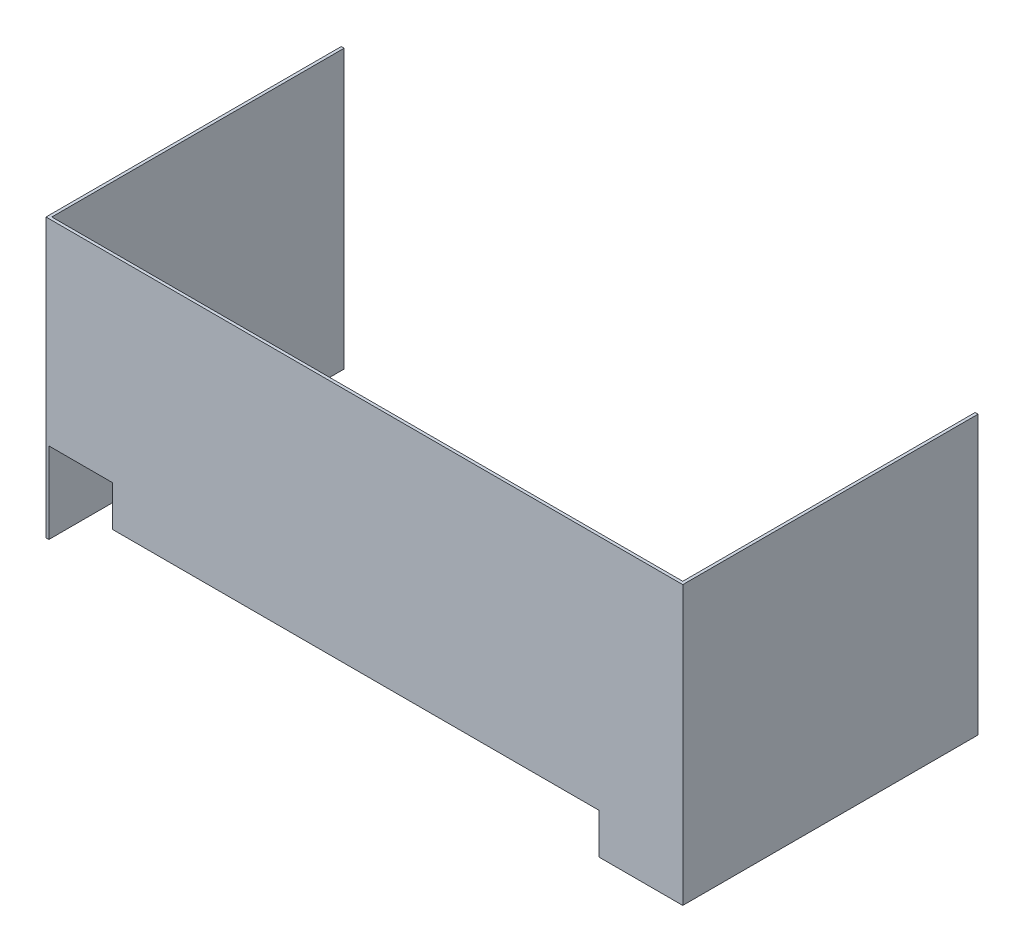
ISO-10303-21;
HEADER;
FILE_DESCRIPTION(('STEP AP214'),'2;1');
FILE_NAME('part.step','',(''),(''),'','','');
FILE_SCHEMA(('AUTOMOTIVE_DESIGN { 1 0 10303 214 1 1 1 1 }'));
ENDSEC;
DATA;
#1=APPLICATION_CONTEXT('core data for automotive mechanical design processes');
#2=APPLICATION_PROTOCOL_DEFINITION('international standard','automotive_design',2000,#1);
#3=PRODUCT_CONTEXT('',#1,'mechanical');
#4=PRODUCT('Part','Part','',(#3));
#5=PRODUCT_RELATED_PRODUCT_CATEGORY('part','',(#4));
#6=PRODUCT_DEFINITION_FORMATION('','',#4);
#7=PRODUCT_DEFINITION_CONTEXT('part definition',#1,'design');
#8=PRODUCT_DEFINITION('design','',#6,#7);
#9=PRODUCT_DEFINITION_SHAPE('','',#8);
#10=(LENGTH_UNIT() NAMED_UNIT(*) SI_UNIT(.MILLI.,.METRE.));
#11=(NAMED_UNIT(*) PLANE_ANGLE_UNIT() SI_UNIT($,.RADIAN.));
#12=(NAMED_UNIT(*) SI_UNIT($,.STERADIAN.) SOLID_ANGLE_UNIT());
#13=UNCERTAINTY_MEASURE_WITH_UNIT(LENGTH_MEASURE(1.E-05),#10,'distance_accuracy_value','');
#14=(GEOMETRIC_REPRESENTATION_CONTEXT(3) GLOBAL_UNCERTAINTY_ASSIGNED_CONTEXT((#13)) GLOBAL_UNIT_ASSIGNED_CONTEXT((#10,
#11,#12)) REPRESENTATION_CONTEXT('',''));
#15=CARTESIAN_POINT('',(0.,0.,0.));
#16=DIRECTION('',(0.,0.,1.));
#17=DIRECTION('',(1.,0.,0.));
#18=AXIS2_PLACEMENT_3D('',#15,#16,#17);
#19=CARTESIAN_POINT('',(292.1,304.8,127.));
#20=DIRECTION('',(0.,0.,1.));
#21=DIRECTION('',(1.,0.,0.));
#22=AXIS2_PLACEMENT_3D('',#19,#20,#21);
#23=PLANE('',#22);
#24=DIRECTION('',(-1.,0.,0.));
#25=VECTOR('',#24,1.);
#26=CARTESIAN_POINT('',(257.175,44.45,127.));
#27=LINE('',#26,#25);
#28=CARTESIAN_POINT('',(257.175,44.45,127.));
#29=VERTEX_POINT('',#28);
#30=CARTESIAN_POINT('',(-276.225,44.45,127.));
#31=VERTEX_POINT('',#30);
#32=EDGE_CURVE('E58',#29,#31,#27,.T.);
#33=ORIENTED_EDGE('',*,*,#32,.F.);
#34=DIRECTION('',(0.,1.,0.));
#35=VECTOR('',#34,1.);
#36=CARTESIAN_POINT('',(257.175,0.,127.));
#37=LINE('',#36,#35);
#38=CARTESIAN_POINT('',(257.175,0.,127.));
#39=VERTEX_POINT('',#38);
#40=EDGE_CURVE('E249',#39,#29,#37,.T.);
#41=ORIENTED_EDGE('',*,*,#40,.F.);
#42=DIRECTION('',(-1.,0.,0.));
#43=VECTOR('',#42,1.);
#44=CARTESIAN_POINT('',(292.1,0.,127.));
#45=LINE('',#44,#43);
#46=CARTESIAN_POINT('',(349.25,0.,127.));
#47=VERTEX_POINT('',#46);
#48=EDGE_CURVE('E161',#47,#39,#45,.T.);
#49=ORIENTED_EDGE('',*,*,#48,.F.);
#50=DIRECTION('',(0.,-1.,0.));
#51=VECTOR('',#50,1.);
#52=CARTESIAN_POINT('',(349.25,304.8,127.));
#53=LINE('',#52,#51);
#54=CARTESIAN_POINT('',(349.25,304.8,127.));
#55=VERTEX_POINT('',#54);
#56=EDGE_CURVE('E175',#55,#47,#53,.T.);
#57=ORIENTED_EDGE('',*,*,#56,.F.);
#58=DIRECTION('',(-1.,0.,0.));
#59=VECTOR('',#58,1.);
#60=CARTESIAN_POINT('',(-349.25,304.8,127.));
#61=LINE('',#60,#59);
#62=CARTESIAN_POINT('',(-349.25,304.8,127.));
#63=VERTEX_POINT('',#62);
#64=EDGE_CURVE('E144',#55,#63,#61,.T.);
#65=ORIENTED_EDGE('',*,*,#64,.T.);
#66=DIRECTION('',(0.,-1.,0.));
#67=VECTOR('',#66,1.);
#68=CARTESIAN_POINT('',(-349.25,304.8,127.));
#69=LINE('',#68,#67);
#70=CARTESIAN_POINT('',(-349.25,0.,127.));
#71=VERTEX_POINT('',#70);
#72=EDGE_CURVE('E177',#63,#71,#69,.T.);
#73=ORIENTED_EDGE('',*,*,#72,.T.);
#74=CARTESIAN_POINT('',(-346.075,0.,127.));
#75=VERTEX_POINT('',#74);
#76=EDGE_CURVE('E160',#75,#71,#45,.T.);
#77=ORIENTED_EDGE('',*,*,#76,.F.);
#78=DIRECTION('',(0.,-1.,0.));
#79=VECTOR('',#78,1.);
#80=CARTESIAN_POINT('',(-346.075,88.9,127.));
#81=LINE('',#80,#79);
#82=CARTESIAN_POINT('',(-346.075,88.9,127.));
#83=VERTEX_POINT('',#82);
#84=EDGE_CURVE('E192',#83,#75,#81,.T.);
#85=ORIENTED_EDGE('',*,*,#84,.F.);
#86=DIRECTION('',(-1.,0.,0.));
#87=VECTOR('',#86,1.);
#88=CARTESIAN_POINT('',(-346.075,88.9,127.));
#89=LINE('',#88,#87);
#90=CARTESIAN_POINT('',(-276.225,88.9,127.));
#91=VERTEX_POINT('',#90);
#92=EDGE_CURVE('E270',#91,#83,#89,.T.);
#93=ORIENTED_EDGE('',*,*,#92,.F.);
#94=DIRECTION('',(0.,1.,0.));
#95=VECTOR('',#94,1.);
#96=CARTESIAN_POINT('',(-276.225,88.9,127.));
#97=LINE('',#96,#95);
#98=EDGE_CURVE('E260',#31,#91,#97,.T.);
#99=ORIENTED_EDGE('',*,*,#98,.F.);
#100=EDGE_LOOP('',(#33,#41,#49,#57,#65,#73,#77,#85,#93,#99));
#101=FACE_BOUND('',#100,.T.);
#102=ADVANCED_FACE('F43',(#101),#23,.T.);
#103=CARTESIAN_POINT('',(-349.25,304.8,123.825));
#104=DIRECTION('',(0.,0.,1.));
#105=DIRECTION('',(1.,0.,0.));
#106=AXIS2_PLACEMENT_3D('',#103,#104,#105);
#107=PLANE('',#106);
#108=DIRECTION('',(0.,1.,0.));
#109=VECTOR('',#108,1.);
#110=CARTESIAN_POINT('',(257.175,0.,123.825));
#111=LINE('',#110,#109);
#112=CARTESIAN_POINT('',(257.175,0.,123.825));
#113=VERTEX_POINT('',#112);
#114=CARTESIAN_POINT('',(257.175,44.45,123.825));
#115=VERTEX_POINT('',#114);
#116=EDGE_CURVE('E264',#113,#115,#111,.T.);
#117=ORIENTED_EDGE('',*,*,#116,.T.);
#118=DIRECTION('',(-1.,0.,0.));
#119=VECTOR('',#118,1.);
#120=CARTESIAN_POINT('',(257.175,44.45,123.825));
#121=LINE('',#120,#119);
#122=CARTESIAN_POINT('',(-276.225,44.45,123.825));
#123=VERTEX_POINT('',#122);
#124=EDGE_CURVE('E253',#115,#123,#121,.T.);
#125=ORIENTED_EDGE('',*,*,#124,.T.);
#126=DIRECTION('',(0.,1.,0.));
#127=VECTOR('',#126,1.);
#128=CARTESIAN_POINT('',(-276.225,304.8,123.825));
#129=LINE('',#128,#127);
#130=CARTESIAN_POINT('',(-276.225,88.9,123.825));
#131=VERTEX_POINT('',#130);
#132=EDGE_CURVE('E154',#123,#131,#129,.T.);
#133=ORIENTED_EDGE('',*,*,#132,.T.);
#134=DIRECTION('',(-1.,0.,0.));
#135=VECTOR('',#134,1.);
#136=CARTESIAN_POINT('',(-349.25,88.9,123.825));
#137=LINE('',#136,#135);
#138=CARTESIAN_POINT('',(-346.075,88.9,123.825));
#139=VERTEX_POINT('',#138);
#140=EDGE_CURVE('E11',#131,#139,#137,.T.);
#141=ORIENTED_EDGE('',*,*,#140,.T.);
#142=DIRECTION('',(0.,-1.,0.));
#143=VECTOR('',#142,1.);
#144=CARTESIAN_POINT('',(-346.075,304.8,123.825));
#145=LINE('',#144,#143);
#146=CARTESIAN_POINT('',(-346.075,304.8,123.825));
#147=VERTEX_POINT('',#146);
#148=EDGE_CURVE('E149',#147,#139,#145,.T.);
#149=ORIENTED_EDGE('',*,*,#148,.F.);
#150=DIRECTION('',(1.,0.,0.));
#151=VECTOR('',#150,1.);
#152=CARTESIAN_POINT('',(292.1,304.8,123.825));
#153=LINE('',#152,#151);
#154=CARTESIAN_POINT('',(346.075,304.8,123.825));
#155=VERTEX_POINT('',#154);
#156=EDGE_CURVE('E67',#155,#147,#153,.F.);
#157=ORIENTED_EDGE('',*,*,#156,.F.);
#158=DIRECTION('',(0.,-1.,0.));
#159=VECTOR('',#158,1.);
#160=CARTESIAN_POINT('',(346.075,304.8,123.825));
#161=LINE('',#160,#159);
#162=CARTESIAN_POINT('',(346.075,0.,123.825));
#163=VERTEX_POINT('',#162);
#164=EDGE_CURVE('E132',#155,#163,#161,.T.);
#165=ORIENTED_EDGE('',*,*,#164,.T.);
#166=DIRECTION('',(1.,0.,0.));
#167=VECTOR('',#166,1.);
#168=CARTESIAN_POINT('',(-349.25,0.,123.825));
#169=LINE('',#168,#167);
#170=EDGE_CURVE('E98',#163,#113,#169,.F.);
#171=ORIENTED_EDGE('',*,*,#170,.T.);
#172=EDGE_LOOP('',(#117,#125,#133,#141,#149,#157,#165,#171));
#173=FACE_BOUND('',#172,.T.);
#174=ADVANCED_FACE('F217',(#173),#107,.F.);
#175=CARTESIAN_POINT('',(0.,0.,0.));
#176=DIRECTION('',(0.,-1.,0.));
#177=DIRECTION('',(-1.,0.,0.));
#178=AXIS2_PLACEMENT_3D('',#175,#176,#177);
#179=PLANE('',#178);
#180=ORIENTED_EDGE('',*,*,#48,.T.);
#181=DIRECTION('',(0.,0.,-1.));
#182=VECTOR('',#181,1.);
#183=CARTESIAN_POINT('',(257.175,0.,127.));
#184=LINE('',#183,#182);
#185=EDGE_CURVE('E252',#39,#113,#184,.T.);
#186=ORIENTED_EDGE('',*,*,#185,.T.);
#187=ORIENTED_EDGE('',*,*,#170,.F.);
#188=DIRECTION('',(0.,0.,-1.));
#189=VECTOR('',#188,1.);
#190=CARTESIAN_POINT('',(346.075,0.,127.));
#191=LINE('',#190,#189);
#192=CARTESIAN_POINT('',(346.075,0.,-196.85));
#193=VERTEX_POINT('',#192);
#194=EDGE_CURVE('E168',#193,#163,#191,.F.);
#195=ORIENTED_EDGE('',*,*,#194,.F.);
#196=DIRECTION('',(1.,0.,0.));
#197=VECTOR('',#196,1.);
#198=CARTESIAN_POINT('',(346.075,0.,-196.85));
#199=LINE('',#198,#197);
#200=CARTESIAN_POINT('',(349.25,0.,-196.85));
#201=VERTEX_POINT('',#200);
#202=EDGE_CURVE('E129',#193,#201,#199,.T.);
#203=ORIENTED_EDGE('',*,*,#202,.T.);
#204=DIRECTION('',(0.,0.,1.));
#205=VECTOR('',#204,1.);
#206=CARTESIAN_POINT('',(349.25,0.,127.));
#207=LINE('',#206,#205);
#208=EDGE_CURVE('E164',#201,#47,#207,.T.);
#209=ORIENTED_EDGE('',*,*,#208,.T.);
#210=EDGE_LOOP('',(#180,#186,#187,#195,#203,#209));
#211=FACE_BOUND('',#210,.T.);
#212=ADVANCED_FACE('F214',(#211),#179,.T.);
#213=CARTESIAN_POINT('',(-276.225,88.9,-196.85));
#214=DIRECTION('',(1.,0.,0.));
#215=DIRECTION('',(0.,0.,-1.));
#216=AXIS2_PLACEMENT_3D('',#213,#214,#215);
#217=PLANE('',#216);
#218=DIRECTION('',(0.,0.,-1.));
#219=VECTOR('',#218,1.);
#220=CARTESIAN_POINT('',(-276.225,44.45,127.));
#221=LINE('',#220,#219);
#222=EDGE_CURVE('E256',#31,#123,#221,.T.);
#223=ORIENTED_EDGE('',*,*,#222,.F.);
#224=ORIENTED_EDGE('',*,*,#98,.T.);
#225=DIRECTION('',(0.,0.,1.));
#226=VECTOR('',#225,1.);
#227=CARTESIAN_POINT('',(-276.225,88.9,-196.85));
#228=LINE('',#227,#226);
#229=EDGE_CURVE('E272',#131,#91,#228,.T.);
#230=ORIENTED_EDGE('',*,*,#229,.F.);
#231=ORIENTED_EDGE('',*,*,#132,.F.);
#232=EDGE_LOOP('',(#223,#224,#230,#231));
#233=FACE_BOUND('',#232,.T.);
#234=ADVANCED_FACE('F278',(#233),#217,.F.);
#235=DIRECTION('',(0.,0.,-1.));
#236=VECTOR('',#235,1.);
#237=CARTESIAN_POINT('',(-346.075,0.,127.));
#238=LINE('',#237,#236);
#239=CARTESIAN_POINT('',(-346.075,0.,-196.85));
#240=VERTEX_POINT('',#239);
#241=EDGE_CURVE('E150',#75,#240,#238,.T.);
#242=ORIENTED_EDGE('',*,*,#241,.F.);
#243=ORIENTED_EDGE('',*,*,#76,.T.);
#244=DIRECTION('',(0.,0.,-1.));
#245=VECTOR('',#244,1.);
#246=CARTESIAN_POINT('',(-349.25,0.,127.));
#247=LINE('',#246,#245);
#248=CARTESIAN_POINT('',(-349.25,0.,-196.85));
#249=VERTEX_POINT('',#248);
#250=EDGE_CURVE('E157',#71,#249,#247,.T.);
#251=ORIENTED_EDGE('',*,*,#250,.T.);
#252=DIRECTION('',(1.,0.,0.));
#253=VECTOR('',#252,1.);
#254=CARTESIAN_POINT('',(-349.25,0.,-196.85));
#255=LINE('',#254,#253);
#256=EDGE_CURVE('E153',#249,#240,#255,.T.);
#257=ORIENTED_EDGE('',*,*,#256,.T.);
#258=EDGE_LOOP('',(#242,#243,#251,#257));
#259=FACE_BOUND('',#258,.T.);
#260=ADVANCED_FACE('F195',(#259),#179,.T.);
#261=CARTESIAN_POINT('',(-346.075,304.8,127.));
#262=DIRECTION('',(-1.,0.,0.));
#263=DIRECTION('',(0.,0.,1.));
#264=AXIS2_PLACEMENT_3D('',#261,#262,#263);
#265=PLANE('',#264);
#266=ORIENTED_EDGE('',*,*,#148,.T.);
#267=DIRECTION('',(0.,0.,1.));
#268=VECTOR('',#267,1.);
#269=CARTESIAN_POINT('',(-346.075,88.9,-196.85));
#270=LINE('',#269,#268);
#271=EDGE_CURVE('E223',#139,#83,#270,.T.);
#272=ORIENTED_EDGE('',*,*,#271,.T.);
#273=ORIENTED_EDGE('',*,*,#84,.T.);
#274=ORIENTED_EDGE('',*,*,#241,.T.);
#275=DIRECTION('',(0.,-1.,0.));
#276=VECTOR('',#275,1.);
#277=CARTESIAN_POINT('',(-346.075,304.8,-196.85));
#278=LINE('',#277,#276);
#279=CARTESIAN_POINT('',(-346.075,304.8,-196.85));
#280=VERTEX_POINT('',#279);
#281=EDGE_CURVE('E51',#280,#240,#278,.T.);
#282=ORIENTED_EDGE('',*,*,#281,.F.);
#283=DIRECTION('',(0.,0.,-1.));
#284=VECTOR('',#283,1.);
#285=CARTESIAN_POINT('',(-346.075,304.8,127.));
#286=LINE('',#285,#284);
#287=EDGE_CURVE('E104',#147,#280,#286,.T.);
#288=ORIENTED_EDGE('',*,*,#287,.F.);
#289=EDGE_LOOP('',(#266,#272,#273,#274,#282,#288));
#290=FACE_BOUND('',#289,.T.);
#291=ADVANCED_FACE('F45',(#290),#265,.F.);
#292=CARTESIAN_POINT('',(-349.25,304.8,-196.85));
#293=DIRECTION('',(0.,0.,-1.));
#294=DIRECTION('',(-1.,0.,0.));
#295=AXIS2_PLACEMENT_3D('',#292,#293,#294);
#296=PLANE('',#295);
#297=ORIENTED_EDGE('',*,*,#256,.F.);
#298=DIRECTION('',(0.,-1.,0.));
#299=VECTOR('',#298,1.);
#300=CARTESIAN_POINT('',(-349.25,304.8,-196.85));
#301=LINE('',#300,#299);
#302=CARTESIAN_POINT('',(-349.25,304.8,-196.85));
#303=VERTEX_POINT('',#302);
#304=EDGE_CURVE('E180',#303,#249,#301,.T.);
#305=ORIENTED_EDGE('',*,*,#304,.F.);
#306=DIRECTION('',(1.,0.,0.));
#307=VECTOR('',#306,1.);
#308=CARTESIAN_POINT('',(-349.25,304.8,-196.85));
#309=LINE('',#308,#307);
#310=EDGE_CURVE('E185',#303,#280,#309,.T.);
#311=ORIENTED_EDGE('',*,*,#310,.T.);
#312=ORIENTED_EDGE('',*,*,#281,.T.);
#313=EDGE_LOOP('',(#297,#305,#311,#312));
#314=FACE_BOUND('',#313,.T.);
#315=ADVANCED_FACE('F184',(#314),#296,.T.);
#316=CARTESIAN_POINT('',(-349.25,304.8,127.));
#317=DIRECTION('',(-1.,0.,0.));
#318=DIRECTION('',(0.,0.,1.));
#319=AXIS2_PLACEMENT_3D('',#316,#317,#318);
#320=PLANE('',#319);
#321=ORIENTED_EDGE('',*,*,#250,.F.);
#322=ORIENTED_EDGE('',*,*,#72,.F.);
#323=DIRECTION('',(0.,0.,-1.));
#324=VECTOR('',#323,1.);
#325=CARTESIAN_POINT('',(-349.25,304.8,127.));
#326=LINE('',#325,#324);
#327=EDGE_CURVE('E201',#63,#303,#326,.T.);
#328=ORIENTED_EDGE('',*,*,#327,.T.);
#329=ORIENTED_EDGE('',*,*,#304,.T.);
#330=EDGE_LOOP('',(#321,#322,#328,#329));
#331=FACE_BOUND('',#330,.T.);
#332=ADVANCED_FACE('F198',(#331),#320,.T.);
#333=CARTESIAN_POINT('',(349.25,304.8,127.));
#334=DIRECTION('',(1.,0.,0.));
#335=DIRECTION('',(0.,0.,-1.));
#336=AXIS2_PLACEMENT_3D('',#333,#334,#335);
#337=PLANE('',#336);
#338=ORIENTED_EDGE('',*,*,#208,.F.);
#339=DIRECTION('',(0.,-1.,0.));
#340=VECTOR('',#339,1.);
#341=CARTESIAN_POINT('',(349.25,304.8,-196.85));
#342=LINE('',#341,#340);
#343=CARTESIAN_POINT('',(349.25,304.8,-196.85));
#344=VERTEX_POINT('',#343);
#345=EDGE_CURVE('E131',#344,#201,#342,.T.);
#346=ORIENTED_EDGE('',*,*,#345,.F.);
#347=DIRECTION('',(0.,0.,1.));
#348=VECTOR('',#347,1.);
#349=CARTESIAN_POINT('',(349.25,304.8,127.));
#350=LINE('',#349,#348);
#351=EDGE_CURVE('E142',#344,#55,#350,.T.);
#352=ORIENTED_EDGE('',*,*,#351,.T.);
#353=ORIENTED_EDGE('',*,*,#56,.T.);
#354=EDGE_LOOP('',(#338,#346,#352,#353));
#355=FACE_BOUND('',#354,.T.);
#356=ADVANCED_FACE('F213',(#355),#337,.T.);
#357=CARTESIAN_POINT('',(346.075,304.8,-196.85));
#358=DIRECTION('',(0.,0.,-1.));
#359=DIRECTION('',(-1.,0.,0.));
#360=AXIS2_PLACEMENT_3D('',#357,#358,#359);
#361=PLANE('',#360);
#362=ORIENTED_EDGE('',*,*,#202,.F.);
#363=DIRECTION('',(0.,-1.,0.));
#364=VECTOR('',#363,1.);
#365=CARTESIAN_POINT('',(346.075,304.8,-196.85));
#366=LINE('',#365,#364);
#367=CARTESIAN_POINT('',(346.075,304.8,-196.85));
#368=VERTEX_POINT('',#367);
#369=EDGE_CURVE('E123',#368,#193,#366,.T.);
#370=ORIENTED_EDGE('',*,*,#369,.F.);
#371=DIRECTION('',(1.,0.,0.));
#372=VECTOR('',#371,1.);
#373=CARTESIAN_POINT('',(346.075,304.8,-196.85));
#374=LINE('',#373,#372);
#375=EDGE_CURVE('E127',#368,#344,#374,.T.);
#376=ORIENTED_EDGE('',*,*,#375,.T.);
#377=ORIENTED_EDGE('',*,*,#345,.T.);
#378=EDGE_LOOP('',(#362,#370,#376,#377));
#379=FACE_BOUND('',#378,.T.);
#380=ADVANCED_FACE('F125',(#379),#361,.T.);
#381=CARTESIAN_POINT('',(346.075,304.8,127.));
#382=DIRECTION('',(1.,0.,0.));
#383=DIRECTION('',(0.,0.,-1.));
#384=AXIS2_PLACEMENT_3D('',#381,#382,#383);
#385=PLANE('',#384);
#386=ORIENTED_EDGE('',*,*,#194,.T.);
#387=ORIENTED_EDGE('',*,*,#164,.F.);
#388=DIRECTION('',(0.,0.,-1.));
#389=VECTOR('',#388,1.);
#390=CARTESIAN_POINT('',(346.075,304.8,127.));
#391=LINE('',#390,#389);
#392=EDGE_CURVE('E135',#368,#155,#391,.F.);
#393=ORIENTED_EDGE('',*,*,#392,.F.);
#394=ORIENTED_EDGE('',*,*,#369,.T.);
#395=EDGE_LOOP('',(#386,#387,#393,#394));
#396=FACE_BOUND('',#395,.T.);
#397=ADVANCED_FACE('F136',(#396),#385,.F.);
#398=CARTESIAN_POINT('',(0.,304.8,0.));
#399=DIRECTION('',(0.,-1.,0.));
#400=DIRECTION('',(-1.,0.,0.));
#401=AXIS2_PLACEMENT_3D('',#398,#399,#400);
#402=PLANE('',#401);
#403=ORIENTED_EDGE('',*,*,#287,.T.);
#404=ORIENTED_EDGE('',*,*,#310,.F.);
#405=ORIENTED_EDGE('',*,*,#327,.F.);
#406=ORIENTED_EDGE('',*,*,#64,.F.);
#407=ORIENTED_EDGE('',*,*,#351,.F.);
#408=ORIENTED_EDGE('',*,*,#375,.F.);
#409=ORIENTED_EDGE('',*,*,#392,.T.);
#410=ORIENTED_EDGE('',*,*,#156,.T.);
#411=EDGE_LOOP('',(#403,#404,#405,#406,#407,#408,#409,#410));
#412=FACE_BOUND('',#411,.T.);
#413=ADVANCED_FACE('F140',(#412),#402,.F.);
#414=CARTESIAN_POINT('',(-346.075,88.9,-196.85));
#415=DIRECTION('',(0.,1.,0.));
#416=DIRECTION('',(0.,0.,1.));
#417=AXIS2_PLACEMENT_3D('',#414,#415,#416);
#418=PLANE('',#417);
#419=ORIENTED_EDGE('',*,*,#229,.T.);
#420=ORIENTED_EDGE('',*,*,#92,.T.);
#421=ORIENTED_EDGE('',*,*,#271,.F.);
#422=ORIENTED_EDGE('',*,*,#140,.F.);
#423=EDGE_LOOP('',(#419,#420,#421,#422));
#424=FACE_BOUND('',#423,.T.);
#425=ADVANCED_FACE('F276',(#424),#418,.F.);
#426=CARTESIAN_POINT('',(257.175,0.,127.));
#427=DIRECTION('',(-1.,0.,0.));
#428=DIRECTION('',(0.,0.,1.));
#429=AXIS2_PLACEMENT_3D('',#426,#427,#428);
#430=PLANE('',#429);
#431=ORIENTED_EDGE('',*,*,#116,.F.);
#432=ORIENTED_EDGE('',*,*,#185,.F.);
#433=ORIENTED_EDGE('',*,*,#40,.T.);
#434=DIRECTION('',(0.,0.,-1.));
#435=VECTOR('',#434,1.);
#436=CARTESIAN_POINT('',(257.175,44.45,127.));
#437=LINE('',#436,#435);
#438=EDGE_CURVE('E251',#29,#115,#437,.T.);
#439=ORIENTED_EDGE('',*,*,#438,.T.);
#440=EDGE_LOOP('',(#431,#432,#433,#439));
#441=FACE_BOUND('',#440,.T.);
#442=ADVANCED_FACE('F250',(#441),#430,.T.);
#443=CARTESIAN_POINT('',(257.175,44.45,127.));
#444=DIRECTION('',(0.,-1.,0.));
#445=DIRECTION('',(0.,0.,-1.));
#446=AXIS2_PLACEMENT_3D('',#443,#444,#445);
#447=PLANE('',#446);
#448=ORIENTED_EDGE('',*,*,#124,.F.);
#449=ORIENTED_EDGE('',*,*,#438,.F.);
#450=ORIENTED_EDGE('',*,*,#32,.T.);
#451=ORIENTED_EDGE('',*,*,#222,.T.);
#452=EDGE_LOOP('',(#448,#449,#450,#451));
#453=FACE_BOUND('',#452,.T.);
#454=ADVANCED_FACE('F255',(#453),#447,.T.);
#455=CLOSED_SHELL('',(#102,#174,#212,#234,#260,#291,#315,#332,#356,#380,#397,#413,#425,#442,#454));
#456=MANIFOLD_SOLID_BREP('B2',#455);
#457=ADVANCED_BREP_SHAPE_REPRESENTATION('',(#18,#456),#14);
#458=SHAPE_DEFINITION_REPRESENTATION(#9,#457);
ENDSEC;
END-ISO-10303-21;
